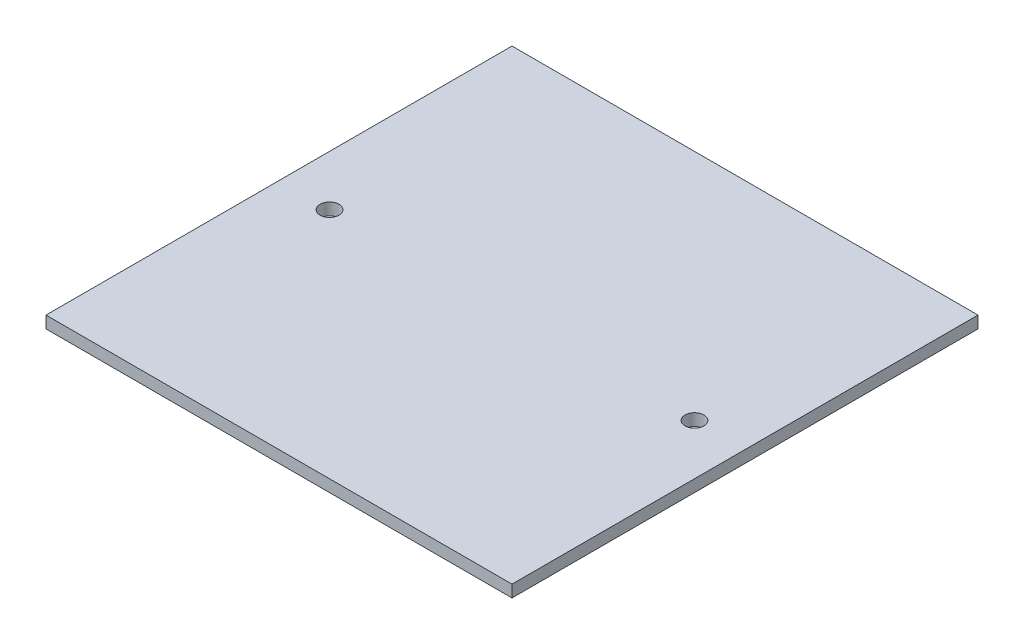
ISO-10303-21;
HEADER;
FILE_DESCRIPTION(('STEP AP214'),'2;1');
FILE_NAME('part.step','',(''),(''),'','','');
FILE_SCHEMA(('AUTOMOTIVE_DESIGN { 1 0 10303 214 1 1 1 1 }'));
ENDSEC;
DATA;
#1=APPLICATION_CONTEXT('core data for automotive mechanical design processes');
#2=APPLICATION_PROTOCOL_DEFINITION('international standard','automotive_design',2000,#1);
#3=PRODUCT_CONTEXT('',#1,'mechanical');
#4=PRODUCT('Part','Part','',(#3));
#5=PRODUCT_RELATED_PRODUCT_CATEGORY('part','',(#4));
#6=PRODUCT_DEFINITION_FORMATION('','',#4);
#7=PRODUCT_DEFINITION_CONTEXT('part definition',#1,'design');
#8=PRODUCT_DEFINITION('design','',#6,#7);
#9=PRODUCT_DEFINITION_SHAPE('','',#8);
#10=(LENGTH_UNIT() NAMED_UNIT(*) SI_UNIT(.MILLI.,.METRE.));
#11=(NAMED_UNIT(*) PLANE_ANGLE_UNIT() SI_UNIT($,.RADIAN.));
#12=(NAMED_UNIT(*) SI_UNIT($,.STERADIAN.) SOLID_ANGLE_UNIT());
#13=UNCERTAINTY_MEASURE_WITH_UNIT(LENGTH_MEASURE(1.E-05),#10,'distance_accuracy_value','');
#14=(GEOMETRIC_REPRESENTATION_CONTEXT(3) GLOBAL_UNCERTAINTY_ASSIGNED_CONTEXT((#13)) GLOBAL_UNIT_ASSIGNED_CONTEXT((#10,
#11,#12)) REPRESENTATION_CONTEXT('',''));
#15=CARTESIAN_POINT('',(0.,0.,0.));
#16=DIRECTION('',(0.,0.,1.));
#17=DIRECTION('',(1.,0.,0.));
#18=AXIS2_PLACEMENT_3D('',#15,#16,#17);
#19=CARTESIAN_POINT('',(36.9,1.9,-36.9));
#20=DIRECTION('',(-1.,0.,0.));
#21=DIRECTION('',(0.,0.,1.));
#22=AXIS2_PLACEMENT_3D('',#19,#20,#21);
#23=PLANE('',#22);
#24=DIRECTION('',(0.,0.,-1.));
#25=VECTOR('',#24,1.);
#26=CARTESIAN_POINT('',(36.9,0.,-36.9));
#27=LINE('',#26,#25);
#28=CARTESIAN_POINT('',(36.9,0.,36.9));
#29=VERTEX_POINT('',#28);
#30=CARTESIAN_POINT('',(36.9,0.,-36.9));
#31=VERTEX_POINT('',#30);
#32=EDGE_CURVE('E111',#29,#31,#27,.T.);
#33=ORIENTED_EDGE('',*,*,#32,.T.);
#34=DIRECTION('',(0.,-1.,0.));
#35=VECTOR('',#34,1.);
#36=CARTESIAN_POINT('',(36.9,1.9,-36.9));
#37=LINE('',#36,#35);
#38=CARTESIAN_POINT('',(36.9,1.9,-36.9));
#39=VERTEX_POINT('',#38);
#40=EDGE_CURVE('E11',#39,#31,#37,.T.);
#41=ORIENTED_EDGE('',*,*,#40,.F.);
#42=DIRECTION('',(0.,0.,-1.));
#43=VECTOR('',#42,1.);
#44=CARTESIAN_POINT('',(36.9,1.9,-36.9));
#45=LINE('',#44,#43);
#46=CARTESIAN_POINT('',(36.9,1.9,36.9));
#47=VERTEX_POINT('',#46);
#48=EDGE_CURVE('E95',#47,#39,#45,.T.);
#49=ORIENTED_EDGE('',*,*,#48,.F.);
#50=DIRECTION('',(0.,-1.,0.));
#51=VECTOR('',#50,1.);
#52=CARTESIAN_POINT('',(36.9,1.9,36.9));
#53=LINE('',#52,#51);
#54=EDGE_CURVE('E107',#47,#29,#53,.T.);
#55=ORIENTED_EDGE('',*,*,#54,.T.);
#56=EDGE_LOOP('',(#33,#41,#49,#55));
#57=FACE_BOUND('',#56,.T.);
#58=ADVANCED_FACE('F43',(#57),#23,.F.);
#59=CARTESIAN_POINT('',(-36.9,1.9,-36.9));
#60=DIRECTION('',(0.,0.,1.));
#61=DIRECTION('',(1.,0.,0.));
#62=AXIS2_PLACEMENT_3D('',#59,#60,#61);
#63=PLANE('',#62);
#64=DIRECTION('',(-1.,0.,0.));
#65=VECTOR('',#64,1.);
#66=CARTESIAN_POINT('',(-36.9,0.,-36.9));
#67=LINE('',#66,#65);
#68=CARTESIAN_POINT('',(-36.9,0.,-36.9));
#69=VERTEX_POINT('',#68);
#70=EDGE_CURVE('E100',#31,#69,#67,.T.);
#71=ORIENTED_EDGE('',*,*,#70,.T.);
#72=DIRECTION('',(0.,-1.,0.));
#73=VECTOR('',#72,1.);
#74=CARTESIAN_POINT('',(-36.9,1.9,-36.9));
#75=LINE('',#74,#73);
#76=CARTESIAN_POINT('',(-36.9,1.9,-36.9));
#77=VERTEX_POINT('',#76);
#78=EDGE_CURVE('E52',#77,#69,#75,.T.);
#79=ORIENTED_EDGE('',*,*,#78,.F.);
#80=DIRECTION('',(-1.,0.,0.));
#81=VECTOR('',#80,1.);
#82=CARTESIAN_POINT('',(-36.9,1.9,-36.9));
#83=LINE('',#82,#81);
#84=EDGE_CURVE('E90',#39,#77,#83,.T.);
#85=ORIENTED_EDGE('',*,*,#84,.F.);
#86=ORIENTED_EDGE('',*,*,#40,.T.);
#87=EDGE_LOOP('',(#71,#79,#85,#86));
#88=FACE_BOUND('',#87,.T.);
#89=ADVANCED_FACE('F99',(#88),#63,.F.);
#90=CARTESIAN_POINT('',(-36.9,1.9,-36.9));
#91=DIRECTION('',(1.,0.,0.));
#92=DIRECTION('',(0.,0.,-1.));
#93=AXIS2_PLACEMENT_3D('',#90,#91,#92);
#94=PLANE('',#93);
#95=DIRECTION('',(0.,0.,1.));
#96=VECTOR('',#95,1.);
#97=CARTESIAN_POINT('',(-36.9,0.,-36.9));
#98=LINE('',#97,#96);
#99=CARTESIAN_POINT('',(-36.9,0.,36.9));
#100=VERTEX_POINT('',#99);
#101=EDGE_CURVE('E77',#69,#100,#98,.T.);
#102=ORIENTED_EDGE('',*,*,#101,.T.);
#103=DIRECTION('',(0.,-1.,0.));
#104=VECTOR('',#103,1.);
#105=CARTESIAN_POINT('',(-36.9,1.9,36.9));
#106=LINE('',#105,#104);
#107=CARTESIAN_POINT('',(-36.9,1.9,36.9));
#108=VERTEX_POINT('',#107);
#109=EDGE_CURVE('E102',#108,#100,#106,.T.);
#110=ORIENTED_EDGE('',*,*,#109,.F.);
#111=DIRECTION('',(0.,0.,1.));
#112=VECTOR('',#111,1.);
#113=CARTESIAN_POINT('',(-36.9,1.9,-36.9));
#114=LINE('',#113,#112);
#115=EDGE_CURVE('E93',#77,#108,#114,.T.);
#116=ORIENTED_EDGE('',*,*,#115,.F.);
#117=ORIENTED_EDGE('',*,*,#78,.T.);
#118=EDGE_LOOP('',(#102,#110,#116,#117));
#119=FACE_BOUND('',#118,.T.);
#120=ADVANCED_FACE('F103',(#119),#94,.F.);
#121=CARTESIAN_POINT('',(-36.9,1.9,36.9));
#122=DIRECTION('',(0.,0.,-1.));
#123=DIRECTION('',(-1.,0.,0.));
#124=AXIS2_PLACEMENT_3D('',#121,#122,#123);
#125=PLANE('',#124);
#126=DIRECTION('',(1.,0.,0.));
#127=VECTOR('',#126,1.);
#128=CARTESIAN_POINT('',(-36.9,0.,36.9));
#129=LINE('',#128,#127);
#130=EDGE_CURVE('E83',#100,#29,#129,.T.);
#131=ORIENTED_EDGE('',*,*,#130,.T.);
#132=ORIENTED_EDGE('',*,*,#54,.F.);
#133=DIRECTION('',(1.,0.,0.));
#134=VECTOR('',#133,1.);
#135=CARTESIAN_POINT('',(-36.9,1.9,36.9));
#136=LINE('',#135,#134);
#137=EDGE_CURVE('E60',#108,#47,#136,.T.);
#138=ORIENTED_EDGE('',*,*,#137,.F.);
#139=ORIENTED_EDGE('',*,*,#109,.T.);
#140=EDGE_LOOP('',(#131,#132,#138,#139));
#141=FACE_BOUND('',#140,.T.);
#142=ADVANCED_FACE('F125',(#141),#125,.F.);
#143=CARTESIAN_POINT('',(0.,1.9,0.));
#144=DIRECTION('',(0.,1.,0.));
#145=DIRECTION('',(0.,0.,1.));
#146=AXIS2_PLACEMENT_3D('',#143,#144,#145);
#147=PLANE('',#146);
#148=CARTESIAN_POINT('',(-28.9,1.9,0.));
#149=DIRECTION('',(0.,1.,0.));
#150=DIRECTION('',(0.,0.,1.));
#151=AXIS2_PLACEMENT_3D('',#148,#149,#150);
#152=CIRCLE('',#151,1.5);
#153=CARTESIAN_POINT('',(-28.9,1.9,1.50000000000001));
#154=VERTEX_POINT('',#153);
#155=EDGE_CURVE('E140',#154,#154,#152,.T.);
#156=ORIENTED_EDGE('',*,*,#155,.F.);
#157=EDGE_LOOP('',(#156));
#158=FACE_BOUND('',#157,.T.);
#159=CARTESIAN_POINT('',(28.9,1.9,0.));
#160=DIRECTION('',(0.,1.,0.));
#161=DIRECTION('',(0.,0.,-1.));
#162=AXIS2_PLACEMENT_3D('',#159,#160,#161);
#163=CIRCLE('',#162,1.5);
#164=CARTESIAN_POINT('',(28.9,1.9,-1.49999999999999));
#165=VERTEX_POINT('',#164);
#166=EDGE_CURVE('E136',#165,#165,#163,.T.);
#167=ORIENTED_EDGE('',*,*,#166,.F.);
#168=EDGE_LOOP('',(#167));
#169=FACE_BOUND('',#168,.T.);
#170=ORIENTED_EDGE('',*,*,#48,.T.);
#171=ORIENTED_EDGE('',*,*,#84,.T.);
#172=ORIENTED_EDGE('',*,*,#115,.T.);
#173=ORIENTED_EDGE('',*,*,#137,.T.);
#174=EDGE_LOOP('',(#170,#171,#172,#173));
#175=FACE_BOUND('',#174,.T.);
#176=ADVANCED_FACE('F91',(#158,#169,#175),#147,.T.);
#177=CARTESIAN_POINT('',(0.,0.,0.));
#178=DIRECTION('',(0.,1.,0.));
#179=DIRECTION('',(0.,0.,1.));
#180=AXIS2_PLACEMENT_3D('',#177,#178,#179);
#181=PLANE('',#180);
#182=CARTESIAN_POINT('',(-28.9,0.,0.));
#183=DIRECTION('',(0.,1.,0.));
#184=DIRECTION('',(0.,0.,1.));
#185=AXIS2_PLACEMENT_3D('',#182,#183,#184);
#186=CIRCLE('',#185,1.5);
#187=CARTESIAN_POINT('',(-28.9,0.,1.50000000000001));
#188=VERTEX_POINT('',#187);
#189=EDGE_CURVE('E115',#188,#188,#186,.T.);
#190=ORIENTED_EDGE('',*,*,#189,.T.);
#191=EDGE_LOOP('',(#190));
#192=FACE_BOUND('',#191,.T.);
#193=CARTESIAN_POINT('',(28.9,0.,0.));
#194=DIRECTION('',(0.,1.,0.));
#195=DIRECTION('',(0.,0.,-1.));
#196=AXIS2_PLACEMENT_3D('',#193,#194,#195);
#197=CIRCLE('',#196,1.5);
#198=CARTESIAN_POINT('',(28.9,0.,-1.49999999999999));
#199=VERTEX_POINT('',#198);
#200=EDGE_CURVE('E132',#199,#199,#197,.T.);
#201=ORIENTED_EDGE('',*,*,#200,.T.);
#202=EDGE_LOOP('',(#201));
#203=FACE_BOUND('',#202,.T.);
#204=ORIENTED_EDGE('',*,*,#32,.F.);
#205=ORIENTED_EDGE('',*,*,#130,.F.);
#206=ORIENTED_EDGE('',*,*,#101,.F.);
#207=ORIENTED_EDGE('',*,*,#70,.F.);
#208=EDGE_LOOP('',(#204,#205,#206,#207));
#209=FACE_BOUND('',#208,.T.);
#210=ADVANCED_FACE('F128',(#192,#203,#209),#181,.F.);
#211=CARTESIAN_POINT('',(28.9,0.,0.));
#212=DIRECTION('',(0.,1.,0.));
#213=DIRECTION('',(0.,0.,1.));
#214=AXIS2_PLACEMENT_3D('',#211,#212,#213);
#215=CYLINDRICAL_SURFACE('',#214,1.5);
#216=ORIENTED_EDGE('',*,*,#200,.F.);
#217=EDGE_LOOP('',(#216));
#218=FACE_BOUND('',#217,.T.);
#219=ORIENTED_EDGE('',*,*,#166,.T.);
#220=EDGE_LOOP('',(#219));
#221=FACE_BOUND('',#220,.T.);
#222=ADVANCED_FACE('F153',(#218,#221),#215,.F.);
#223=CARTESIAN_POINT('',(-28.9,0.,0.));
#224=DIRECTION('',(0.,1.,0.));
#225=DIRECTION('',(0.,0.,1.));
#226=AXIS2_PLACEMENT_3D('',#223,#224,#225);
#227=CYLINDRICAL_SURFACE('',#226,1.5);
#228=ORIENTED_EDGE('',*,*,#189,.F.);
#229=EDGE_LOOP('',(#228));
#230=FACE_BOUND('',#229,.T.);
#231=ORIENTED_EDGE('',*,*,#155,.T.);
#232=EDGE_LOOP('',(#231));
#233=FACE_BOUND('',#232,.T.);
#234=ADVANCED_FACE('F150',(#230,#233),#227,.F.);
#235=CLOSED_SHELL('',(#58,#89,#120,#142,#176,#210,#222,#234));
#236=MANIFOLD_SOLID_BREP('B2',#235);
#237=ADVANCED_BREP_SHAPE_REPRESENTATION('',(#18,#236),#14);
#238=SHAPE_DEFINITION_REPRESENTATION(#9,#237);
ENDSEC;
END-ISO-10303-21;
